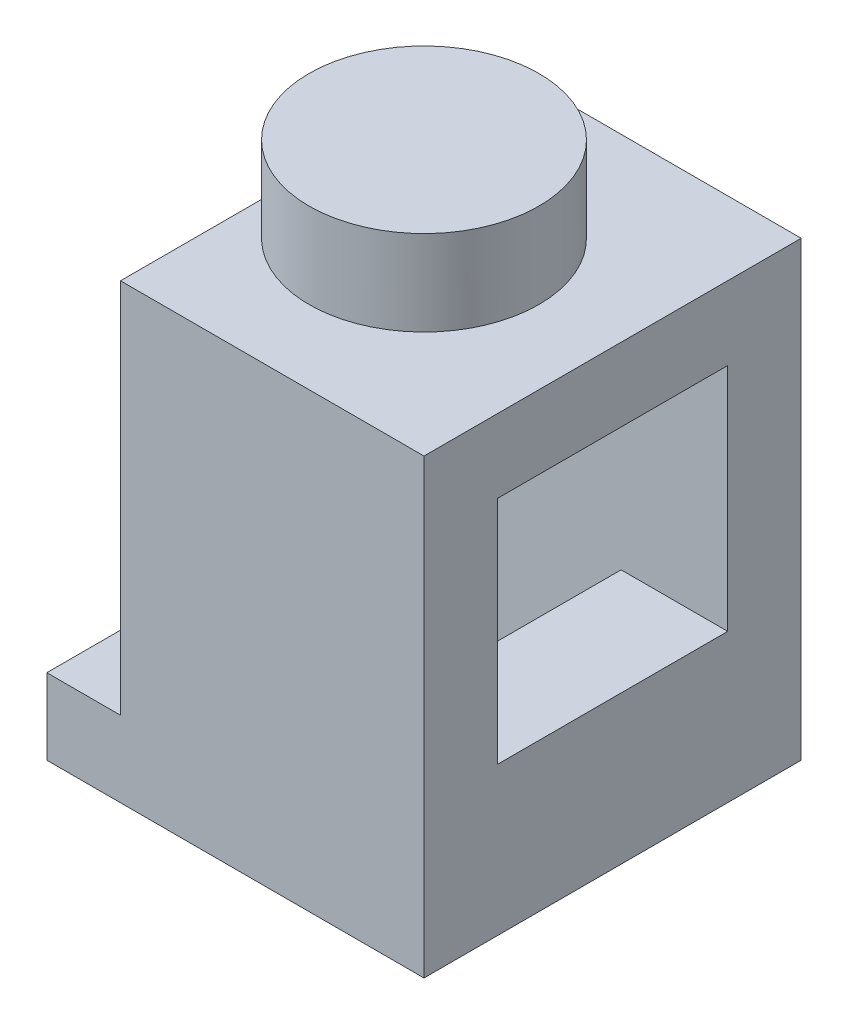
ISO-10303-21;
HEADER;
FILE_DESCRIPTION(('STEP AP214'),'2;1');
FILE_NAME('part.step','',(''),(''),'','','');
FILE_SCHEMA(('AUTOMOTIVE_DESIGN { 1 0 10303 214 1 1 1 1 }'));
ENDSEC;
DATA;
#1=APPLICATION_CONTEXT('core data for automotive mechanical design processes');
#2=APPLICATION_PROTOCOL_DEFINITION('international standard','automotive_design',2000,#1);
#3=PRODUCT_CONTEXT('',#1,'mechanical');
#4=PRODUCT('Part','Part','',(#3));
#5=PRODUCT_RELATED_PRODUCT_CATEGORY('part','',(#4));
#6=PRODUCT_DEFINITION_FORMATION('','',#4);
#7=PRODUCT_DEFINITION_CONTEXT('part definition',#1,'design');
#8=PRODUCT_DEFINITION('design','',#6,#7);
#9=PRODUCT_DEFINITION_SHAPE('','',#8);
#10=(LENGTH_UNIT() NAMED_UNIT(*) SI_UNIT(.MILLI.,.METRE.));
#11=(NAMED_UNIT(*) PLANE_ANGLE_UNIT() SI_UNIT($,.RADIAN.));
#12=(NAMED_UNIT(*) SI_UNIT($,.STERADIAN.) SOLID_ANGLE_UNIT());
#13=UNCERTAINTY_MEASURE_WITH_UNIT(LENGTH_MEASURE(1.E-05),#10,'distance_accuracy_value','');
#14=(GEOMETRIC_REPRESENTATION_CONTEXT(3) GLOBAL_UNCERTAINTY_ASSIGNED_CONTEXT((#13)) GLOBAL_UNIT_ASSIGNED_CONTEXT((#10,
#11,#12)) REPRESENTATION_CONTEXT('',''));
#15=CARTESIAN_POINT('',(0.,0.,0.));
#16=DIRECTION('',(0.,0.,1.));
#17=DIRECTION('',(1.,0.,0.));
#18=AXIS2_PLACEMENT_3D('',#15,#16,#17);
#19=CARTESIAN_POINT('',(-2.425,1.6,-3.98));
#20=DIRECTION('',(1.,0.,0.));
#21=DIRECTION('',(0.,0.,-1.));
#22=AXIS2_PLACEMENT_3D('',#19,#20,#21);
#23=PLANE('',#22);
#24=DIRECTION('',(0.,0.,1.));
#25=VECTOR('',#24,1.);
#26=CARTESIAN_POINT('',(-2.425,1.6,2.43));
#27=LINE('',#26,#25);
#28=CARTESIAN_POINT('',(-2.425,1.6,-2.43));
#29=VERTEX_POINT('',#28);
#30=CARTESIAN_POINT('',(-2.425,1.6,2.43));
#31=VERTEX_POINT('',#30);
#32=EDGE_CURVE('E205',#29,#31,#27,.T.);
#33=ORIENTED_EDGE('',*,*,#32,.T.);
#34=DIRECTION('',(0.,0.,-1.));
#35=VECTOR('',#34,1.);
#36=CARTESIAN_POINT('',(-2.425,1.6,-3.98));
#37=LINE('',#36,#35);
#38=CARTESIAN_POINT('',(-2.425,1.6,3.98));
#39=VERTEX_POINT('',#38);
#40=EDGE_CURVE('E226',#39,#31,#37,.T.);
#41=ORIENTED_EDGE('',*,*,#40,.F.);
#42=DIRECTION('',(0.,1.,0.));
#43=VECTOR('',#42,1.);
#44=CARTESIAN_POINT('',(-2.425,1.6,3.98));
#45=LINE('',#44,#43);
#46=CARTESIAN_POINT('',(-2.425,9.54,3.98));
#47=VERTEX_POINT('',#46);
#48=EDGE_CURVE('E231',#39,#47,#45,.T.);
#49=ORIENTED_EDGE('',*,*,#48,.T.);
#50=DIRECTION('',(0.,0.,-1.));
#51=VECTOR('',#50,1.);
#52=CARTESIAN_POINT('',(-2.425,9.54,-3.98));
#53=LINE('',#52,#51);
#54=CARTESIAN_POINT('',(-2.425,9.54,0.));
#55=VERTEX_POINT('',#54);
#56=EDGE_CURVE('E222',#47,#55,#53,.T.);
#57=ORIENTED_EDGE('',*,*,#56,.T.);
#58=CARTESIAN_POINT('',(-2.425,9.54,-3.98));
#59=VERTEX_POINT('',#58);
#60=EDGE_CURVE('E208',#55,#59,#53,.T.);
#61=ORIENTED_EDGE('',*,*,#60,.T.);
#62=DIRECTION('',(0.,1.,0.));
#63=VECTOR('',#62,1.);
#64=CARTESIAN_POINT('',(-2.425,1.6,-3.98));
#65=LINE('',#64,#63);
#66=CARTESIAN_POINT('',(-2.425,1.6,-3.98));
#67=VERTEX_POINT('',#66);
#68=EDGE_CURVE('E233',#67,#59,#65,.T.);
#69=ORIENTED_EDGE('',*,*,#68,.F.);
#70=EDGE_CURVE('E225',#29,#67,#37,.T.);
#71=ORIENTED_EDGE('',*,*,#70,.F.);
#72=EDGE_LOOP('',(#33,#41,#49,#57,#61,#69,#71));
#73=FACE_BOUND('',#72,.T.);
#74=CARTESIAN_POINT('',(-2.425,5.56,0.));
#75=DIRECTION('',(1.,0.,0.));
#76=DIRECTION('',(0.,0.,-1.));
#77=AXIS2_PLACEMENT_3D('',#74,#75,#76);
#78=CIRCLE('',#77,2.425);
#79=CARTESIAN_POINT('',(-2.425,5.56,-2.425));
#80=VERTEX_POINT('',#79);
#81=EDGE_CURVE('E11',#80,#80,#78,.F.);
#82=ORIENTED_EDGE('',*,*,#81,.F.);
#83=EDGE_LOOP('',(#82));
#84=FACE_BOUND('',#83,.T.);
#85=ADVANCED_FACE('F30',(#73,#84),#23,.F.);
#86=CARTESIAN_POINT('',(1.73,-3.3101527471149,2.43));
#87=DIRECTION('',(1.,0.,0.));
#88=DIRECTION('',(0.,0.,-1.));
#89=AXIS2_PLACEMENT_3D('',#86,#87,#88);
#90=PLANE('',#89);
#91=DIRECTION('',(0.,1.,0.));
#92=VECTOR('',#91,1.);
#93=CARTESIAN_POINT('',(1.73,-3.3101527471149,2.43));
#94=LINE('',#93,#92);
#95=CARTESIAN_POINT('',(1.73,1.6,2.43));
#96=VERTEX_POINT('',#95);
#97=CARTESIAN_POINT('',(1.73,3.13,2.43));
#98=VERTEX_POINT('',#97);
#99=EDGE_CURVE('E186',#96,#98,#94,.T.);
#100=ORIENTED_EDGE('',*,*,#99,.T.);
#101=DIRECTION('',(0.,0.,1.));
#102=VECTOR('',#101,1.);
#103=CARTESIAN_POINT('',(1.73,3.13,2.43));
#104=LINE('',#103,#102);
#105=CARTESIAN_POINT('',(1.73,3.13,-2.43));
#106=VERTEX_POINT('',#105);
#107=EDGE_CURVE('E53',#106,#98,#104,.T.);
#108=ORIENTED_EDGE('',*,*,#107,.F.);
#109=DIRECTION('',(0.,1.,0.));
#110=VECTOR('',#109,1.);
#111=CARTESIAN_POINT('',(1.73,-3.3101527471149,-2.43));
#112=LINE('',#111,#110);
#113=CARTESIAN_POINT('',(1.73,1.6,-2.43));
#114=VERTEX_POINT('',#113);
#115=EDGE_CURVE('E187',#114,#106,#112,.T.);
#116=ORIENTED_EDGE('',*,*,#115,.F.);
#117=DIRECTION('',(0.,0.,1.));
#118=VECTOR('',#117,1.);
#119=CARTESIAN_POINT('',(1.73,1.6,2.43));
#120=LINE('',#119,#118);
#121=EDGE_CURVE('E197',#114,#96,#120,.T.);
#122=ORIENTED_EDGE('',*,*,#121,.T.);
#123=EDGE_LOOP('',(#100,#108,#116,#122));
#124=FACE_BOUND('',#123,.T.);
#125=ADVANCED_FACE('F366',(#124),#90,.F.);
#126=CARTESIAN_POINT('',(-3.98,9.54,-2.43));
#127=DIRECTION('',(0.,0.,1.));
#128=DIRECTION('',(1.,0.,0.));
#129=AXIS2_PLACEMENT_3D('',#126,#127,#128);
#130=PLANE('',#129);
#131=DIRECTION('',(-1.,0.,0.));
#132=VECTOR('',#131,1.);
#133=CARTESIAN_POINT('',(2.43,1.6,-2.43));
#134=LINE('',#133,#132);
#135=CARTESIAN_POINT('',(2.43,1.6,-2.43));
#136=VERTEX_POINT('',#135);
#137=EDGE_CURVE('E190',#136,#114,#134,.T.);
#138=ORIENTED_EDGE('',*,*,#137,.T.);
#139=ORIENTED_EDGE('',*,*,#115,.T.);
#140=DIRECTION('',(1.,0.,0.));
#141=VECTOR('',#140,1.);
#142=CARTESIAN_POINT('',(-3.981,3.13,-2.43));
#143=LINE('',#142,#141);
#144=CARTESIAN_POINT('',(3.98,3.13,-2.43));
#145=VERTEX_POINT('',#144);
#146=EDGE_CURVE('E625',#106,#145,#143,.T.);
#147=ORIENTED_EDGE('',*,*,#146,.T.);
#148=DIRECTION('',(0.,1.,0.));
#149=VECTOR('',#148,1.);
#150=CARTESIAN_POINT('',(3.98,7.99,-2.43));
#151=LINE('',#150,#149);
#152=CARTESIAN_POINT('',(3.98,7.99,-2.43));
#153=VERTEX_POINT('',#152);
#154=EDGE_CURVE('E617',#145,#153,#151,.T.);
#155=ORIENTED_EDGE('',*,*,#154,.T.);
#156=DIRECTION('',(1.,0.,0.));
#157=VECTOR('',#156,1.);
#158=CARTESIAN_POINT('',(-3.981,7.99,-2.43));
#159=LINE('',#158,#157);
#160=CARTESIAN_POINT('',(1.73,7.99,-2.43));
#161=VERTEX_POINT('',#160);
#162=EDGE_CURVE('E172',#161,#153,#159,.T.);
#163=ORIENTED_EDGE('',*,*,#162,.F.);
#164=CARTESIAN_POINT('',(1.73,8.13,-2.43));
#165=VERTEX_POINT('',#164);
#166=EDGE_CURVE('E179',#161,#165,#112,.T.);
#167=ORIENTED_EDGE('',*,*,#166,.T.);
#168=DIRECTION('',(1.,0.,0.));
#169=VECTOR('',#168,1.);
#170=CARTESIAN_POINT('',(2.43,8.13,-2.43));
#171=LINE('',#170,#169);
#172=CARTESIAN_POINT('',(-1.725,8.13,-2.43));
#173=VERTEX_POINT('',#172);
#174=EDGE_CURVE('E244',#173,#165,#171,.T.);
#175=ORIENTED_EDGE('',*,*,#174,.F.);
#176=DIRECTION('',(0.,1.,0.));
#177=VECTOR('',#176,1.);
#178=CARTESIAN_POINT('',(-1.725,-3.3101527471149,-2.43));
#179=LINE('',#178,#177);
#180=CARTESIAN_POINT('',(-1.725,1.6,-2.43));
#181=VERTEX_POINT('',#180);
#182=EDGE_CURVE('E215',#181,#173,#179,.T.);
#183=ORIENTED_EDGE('',*,*,#182,.F.);
#184=DIRECTION('',(-1.,0.,0.));
#185=VECTOR('',#184,1.);
#186=CARTESIAN_POINT('',(-2.425,1.6,-2.43));
#187=LINE('',#186,#185);
#188=EDGE_CURVE('E201',#181,#29,#187,.T.);
#189=ORIENTED_EDGE('',*,*,#188,.T.);
#190=DIRECTION('',(-1.,0.,0.));
#191=VECTOR('',#190,1.);
#192=CARTESIAN_POINT('',(-3.98,1.6,-2.43));
#193=LINE('',#192,#191);
#194=CARTESIAN_POINT('',(-2.43,1.6,-2.43));
#195=VERTEX_POINT('',#194);
#196=EDGE_CURVE('E240',#29,#195,#193,.T.);
#197=ORIENTED_EDGE('',*,*,#196,.T.);
#198=DIRECTION('',(0.,-1.,0.));
#199=VECTOR('',#198,1.);
#200=CARTESIAN_POINT('',(-2.43,9.54,-2.43));
#201=LINE('',#200,#199);
#202=CARTESIAN_POINT('',(-2.43,0.,-2.43));
#203=VERTEX_POINT('',#202);
#204=EDGE_CURVE('E251',#195,#203,#201,.T.);
#205=ORIENTED_EDGE('',*,*,#204,.T.);
#206=DIRECTION('',(-1.,0.,0.));
#207=VECTOR('',#206,1.);
#208=CARTESIAN_POINT('',(-3.98,0.,-2.43));
#209=LINE('',#208,#207);
#210=CARTESIAN_POINT('',(2.43,0.,-2.43));
#211=VERTEX_POINT('',#210);
#212=EDGE_CURVE('E264',#211,#203,#209,.T.);
#213=ORIENTED_EDGE('',*,*,#212,.F.);
#214=DIRECTION('',(0.,-1.,0.));
#215=VECTOR('',#214,1.);
#216=CARTESIAN_POINT('',(2.43,9.54,-2.43));
#217=LINE('',#216,#215);
#218=EDGE_CURVE('E248',#136,#211,#217,.T.);
#219=ORIENTED_EDGE('',*,*,#218,.F.);
#220=EDGE_LOOP('',(#138,#139,#147,#155,#163,#167,#175,#183,#189,#197,#205,#213,#219));
#221=FACE_BOUND('',#220,.T.);
#222=ADVANCED_FACE('F319',(#221),#130,.T.);
#223=CARTESIAN_POINT('',(-3.98,9.54,2.43));
#224=DIRECTION('',(0.,0.,-1.));
#225=DIRECTION('',(-1.,0.,0.));
#226=AXIS2_PLACEMENT_3D('',#223,#224,#225);
#227=PLANE('',#226);
#228=DIRECTION('',(-1.,0.,0.));
#229=VECTOR('',#228,1.);
#230=CARTESIAN_POINT('',(-2.43,8.13,2.43));
#231=LINE('',#230,#229);
#232=CARTESIAN_POINT('',(1.73,8.13,2.43));
#233=VERTEX_POINT('',#232);
#234=CARTESIAN_POINT('',(-1.725,8.13,2.43));
#235=VERTEX_POINT('',#234);
#236=EDGE_CURVE('E185',#233,#235,#231,.T.);
#237=ORIENTED_EDGE('',*,*,#236,.F.);
#238=CARTESIAN_POINT('',(1.73,7.99,2.43));
#239=VERTEX_POINT('',#238);
#240=EDGE_CURVE('E177',#239,#233,#94,.T.);
#241=ORIENTED_EDGE('',*,*,#240,.F.);
#242=DIRECTION('',(1.,0.,0.));
#243=VECTOR('',#242,1.);
#244=CARTESIAN_POINT('',(-3.981,7.99,2.43));
#245=LINE('',#244,#243);
#246=CARTESIAN_POINT('',(3.98,7.99,2.43));
#247=VERTEX_POINT('',#246);
#248=EDGE_CURVE('E162',#239,#247,#245,.T.);
#249=ORIENTED_EDGE('',*,*,#248,.T.);
#250=DIRECTION('',(0.,-1.,0.));
#251=VECTOR('',#250,1.);
#252=CARTESIAN_POINT('',(3.98,7.99,2.43));
#253=LINE('',#252,#251);
#254=CARTESIAN_POINT('',(3.98,3.13,2.43));
#255=VERTEX_POINT('',#254);
#256=EDGE_CURVE('E627',#247,#255,#253,.T.);
#257=ORIENTED_EDGE('',*,*,#256,.T.);
#258=DIRECTION('',(1.,0.,0.));
#259=VECTOR('',#258,1.);
#260=CARTESIAN_POINT('',(-3.981,3.13,2.43));
#261=LINE('',#260,#259);
#262=EDGE_CURVE('E171',#98,#255,#261,.T.);
#263=ORIENTED_EDGE('',*,*,#262,.F.);
#264=ORIENTED_EDGE('',*,*,#99,.F.);
#265=DIRECTION('',(1.,0.,0.));
#266=VECTOR('',#265,1.);
#267=CARTESIAN_POINT('',(2.43,1.6,2.43));
#268=LINE('',#267,#266);
#269=CARTESIAN_POINT('',(2.43,1.6,2.43));
#270=VERTEX_POINT('',#269);
#271=EDGE_CURVE('E638',#96,#270,#268,.T.);
#272=ORIENTED_EDGE('',*,*,#271,.T.);
#273=DIRECTION('',(0.,-1.,0.));
#274=VECTOR('',#273,1.);
#275=CARTESIAN_POINT('',(2.43,9.54,2.43));
#276=LINE('',#275,#274);
#277=CARTESIAN_POINT('',(2.43,0.,2.43));
#278=VERTEX_POINT('',#277);
#279=EDGE_CURVE('E252',#270,#278,#276,.T.);
#280=ORIENTED_EDGE('',*,*,#279,.T.);
#281=DIRECTION('',(1.,0.,0.));
#282=VECTOR('',#281,1.);
#283=CARTESIAN_POINT('',(-3.98,0.,2.43));
#284=LINE('',#283,#282);
#285=CARTESIAN_POINT('',(-2.43,0.,2.43));
#286=VERTEX_POINT('',#285);
#287=EDGE_CURVE('E255',#286,#278,#284,.T.);
#288=ORIENTED_EDGE('',*,*,#287,.F.);
#289=DIRECTION('',(0.,-1.,0.));
#290=VECTOR('',#289,1.);
#291=CARTESIAN_POINT('',(-2.43,9.54,2.43));
#292=LINE('',#291,#290);
#293=CARTESIAN_POINT('',(-2.43,1.6,2.43));
#294=VERTEX_POINT('',#293);
#295=EDGE_CURVE('E254',#294,#286,#292,.T.);
#296=ORIENTED_EDGE('',*,*,#295,.F.);
#297=DIRECTION('',(1.,0.,0.));
#298=VECTOR('',#297,1.);
#299=CARTESIAN_POINT('',(-3.98,1.6,2.43));
#300=LINE('',#299,#298);
#301=EDGE_CURVE('E38',#294,#31,#300,.T.);
#302=ORIENTED_EDGE('',*,*,#301,.T.);
#303=DIRECTION('',(1.,0.,0.));
#304=VECTOR('',#303,1.);
#305=CARTESIAN_POINT('',(-2.425,1.6,2.43));
#306=LINE('',#305,#304);
#307=CARTESIAN_POINT('',(-1.725,1.6,2.43));
#308=VERTEX_POINT('',#307);
#309=EDGE_CURVE('E202',#31,#308,#306,.T.);
#310=ORIENTED_EDGE('',*,*,#309,.T.);
#311=DIRECTION('',(0.,1.,0.));
#312=VECTOR('',#311,1.);
#313=CARTESIAN_POINT('',(-1.725,-3.3101527471149,2.43));
#314=LINE('',#313,#312);
#315=EDGE_CURVE('E212',#308,#235,#314,.T.);
#316=ORIENTED_EDGE('',*,*,#315,.T.);
#317=EDGE_LOOP('',(#237,#241,#249,#257,#263,#264,#272,#280,#288,#296,#302,#310,#316));
#318=FACE_BOUND('',#317,.T.);
#319=ADVANCED_FACE('F183',(#318),#227,.T.);
#320=CARTESIAN_POINT('',(2.43,8.13,-2.43));
#321=DIRECTION('',(0.,1.,0.));
#322=DIRECTION('',(0.,0.,1.));
#323=AXIS2_PLACEMENT_3D('',#320,#321,#322);
#324=PLANE('',#323);
#325=CARTESIAN_POINT('',(0.,8.13,0.));
#326=DIRECTION('',(0.,1.,0.));
#327=DIRECTION('',(0.,0.,1.));
#328=AXIS2_PLACEMENT_3D('',#325,#326,#327);
#329=CIRCLE('',#328,0.875);
#330=CARTESIAN_POINT('',(0.,8.13,0.875));
#331=VERTEX_POINT('',#330);
#332=EDGE_CURVE('E247',#331,#331,#329,.T.);
#333=ORIENTED_EDGE('',*,*,#332,.T.);
#334=EDGE_LOOP('',(#333));
#335=FACE_BOUND('',#334,.T.);
#336=DIRECTION('',(0.,0.,-1.));
#337=VECTOR('',#336,1.);
#338=CARTESIAN_POINT('',(1.73,8.13,2.43));
#339=LINE('',#338,#337);
#340=EDGE_CURVE('E635',#233,#165,#339,.T.);
#341=ORIENTED_EDGE('',*,*,#340,.F.);
#342=ORIENTED_EDGE('',*,*,#236,.T.);
#343=DIRECTION('',(0.,0.,1.));
#344=VECTOR('',#343,1.);
#345=CARTESIAN_POINT('',(-1.725,8.13,2.43));
#346=LINE('',#345,#344);
#347=EDGE_CURVE('E209',#173,#235,#346,.T.);
#348=ORIENTED_EDGE('',*,*,#347,.F.);
#349=ORIENTED_EDGE('',*,*,#174,.T.);
#350=EDGE_LOOP('',(#341,#342,#348,#349));
#351=FACE_BOUND('',#350,.T.);
#352=ADVANCED_FACE('F376',(#335,#351),#324,.F.);
#353=CARTESIAN_POINT('',(2.43,9.54,-3.98));
#354=DIRECTION('',(-1.,0.,0.));
#355=DIRECTION('',(0.,0.,1.));
#356=AXIS2_PLACEMENT_3D('',#353,#354,#355);
#357=PLANE('',#356);
#358=ORIENTED_EDGE('',*,*,#279,.F.);
#359=DIRECTION('',(0.,0.,-1.));
#360=VECTOR('',#359,1.);
#361=CARTESIAN_POINT('',(2.43,1.6,2.43));
#362=LINE('',#361,#360);
#363=EDGE_CURVE('E213',#270,#136,#362,.T.);
#364=ORIENTED_EDGE('',*,*,#363,.T.);
#365=ORIENTED_EDGE('',*,*,#218,.T.);
#366=DIRECTION('',(0.,0.,-1.));
#367=VECTOR('',#366,1.);
#368=CARTESIAN_POINT('',(2.43,0.,-3.98));
#369=LINE('',#368,#367);
#370=EDGE_CURVE('E261',#278,#211,#369,.T.);
#371=ORIENTED_EDGE('',*,*,#370,.F.);
#372=EDGE_LOOP('',(#358,#364,#365,#371));
#373=FACE_BOUND('',#372,.T.);
#374=ADVANCED_FACE('F379',(#373),#357,.T.);
#375=CARTESIAN_POINT('',(-3.98,9.54,-3.98));
#376=DIRECTION('',(1.,0.,0.));
#377=DIRECTION('',(0.,0.,-1.));
#378=AXIS2_PLACEMENT_3D('',#375,#376,#377);
#379=PLANE('',#378);
#380=DIRECTION('',(0.,0.,1.));
#381=VECTOR('',#380,1.);
#382=CARTESIAN_POINT('',(-3.98,1.6,-3.98));
#383=LINE('',#382,#381);
#384=CARTESIAN_POINT('',(-3.98,1.6,-3.98));
#385=VERTEX_POINT('',#384);
#386=CARTESIAN_POINT('',(-3.98,1.6,3.98));
#387=VERTEX_POINT('',#386);
#388=EDGE_CURVE('E219',#385,#387,#383,.T.);
#389=ORIENTED_EDGE('',*,*,#388,.F.);
#390=DIRECTION('',(0.,-1.,0.));
#391=VECTOR('',#390,1.);
#392=CARTESIAN_POINT('',(-3.98,9.54,-3.98));
#393=LINE('',#392,#391);
#394=CARTESIAN_POINT('',(-3.98,0.,-3.98));
#395=VERTEX_POINT('',#394);
#396=EDGE_CURVE('E301',#385,#395,#393,.T.);
#397=ORIENTED_EDGE('',*,*,#396,.T.);
#398=DIRECTION('',(0.,0.,1.));
#399=VECTOR('',#398,1.);
#400=CARTESIAN_POINT('',(-3.98,0.,-3.98));
#401=LINE('',#400,#399);
#402=CARTESIAN_POINT('',(-3.98,0.,3.98));
#403=VERTEX_POINT('',#402);
#404=EDGE_CURVE('E293',#395,#403,#401,.T.);
#405=ORIENTED_EDGE('',*,*,#404,.T.);
#406=DIRECTION('',(0.,-1.,0.));
#407=VECTOR('',#406,1.);
#408=CARTESIAN_POINT('',(-3.98,9.54,3.98));
#409=LINE('',#408,#407);
#410=EDGE_CURVE('E299',#387,#403,#409,.T.);
#411=ORIENTED_EDGE('',*,*,#410,.F.);
#412=EDGE_LOOP('',(#389,#397,#405,#411));
#413=FACE_BOUND('',#412,.T.);
#414=ADVANCED_FACE('F335',(#413),#379,.F.);
#415=CARTESIAN_POINT('',(-2.43,9.54,-3.98));
#416=DIRECTION('',(1.,0.,0.));
#417=DIRECTION('',(0.,0.,-1.));
#418=AXIS2_PLACEMENT_3D('',#415,#416,#417);
#419=PLANE('',#418);
#420=ORIENTED_EDGE('',*,*,#204,.F.);
#421=DIRECTION('',(0.,0.,1.));
#422=VECTOR('',#421,1.);
#423=CARTESIAN_POINT('',(-2.43,1.6,-3.98));
#424=LINE('',#423,#422);
#425=EDGE_CURVE('E236',#195,#294,#424,.T.);
#426=ORIENTED_EDGE('',*,*,#425,.T.);
#427=ORIENTED_EDGE('',*,*,#295,.T.);
#428=DIRECTION('',(0.,0.,1.));
#429=VECTOR('',#428,1.);
#430=CARTESIAN_POINT('',(-2.43,0.,-3.98));
#431=LINE('',#430,#429);
#432=EDGE_CURVE('E267',#203,#286,#431,.T.);
#433=ORIENTED_EDGE('',*,*,#432,.F.);
#434=EDGE_LOOP('',(#420,#426,#427,#433));
#435=FACE_BOUND('',#434,.T.);
#436=ADVANCED_FACE('F315',(#435),#419,.T.);
#437=CARTESIAN_POINT('',(3.98,9.54,3.98));
#438=DIRECTION('',(0.,1.,0.));
#439=DIRECTION('',(0.,0.,1.));
#440=AXIS2_PLACEMENT_3D('',#437,#438,#439);
#441=PLANE('',#440);
#442=ORIENTED_EDGE('',*,*,#56,.F.);
#443=DIRECTION('',(1.,0.,0.));
#444=VECTOR('',#443,1.);
#445=CARTESIAN_POINT('',(-3.98,9.54,3.98));
#446=LINE('',#445,#444);
#447=CARTESIAN_POINT('',(3.98,9.54,3.98));
#448=VERTEX_POINT('',#447);
#449=EDGE_CURVE('E285',#47,#448,#446,.T.);
#450=ORIENTED_EDGE('',*,*,#449,.T.);
#451=DIRECTION('',(0.,0.,-1.));
#452=VECTOR('',#451,1.);
#453=CARTESIAN_POINT('',(3.98,9.54,-3.98));
#454=LINE('',#453,#452);
#455=CARTESIAN_POINT('',(3.98,9.54,-3.98));
#456=VERTEX_POINT('',#455);
#457=EDGE_CURVE('E278',#448,#456,#454,.T.);
#458=ORIENTED_EDGE('',*,*,#457,.T.);
#459=DIRECTION('',(-1.,0.,0.));
#460=VECTOR('',#459,1.);
#461=CARTESIAN_POINT('',(-3.98,9.54,-3.98));
#462=LINE('',#461,#460);
#463=EDGE_CURVE('E281',#456,#59,#462,.T.);
#464=ORIENTED_EDGE('',*,*,#463,.T.);
#465=ORIENTED_EDGE('',*,*,#60,.F.);
#466=CARTESIAN_POINT('',(0.,9.54,0.));
#467=DIRECTION('',(0.,1.,0.));
#468=DIRECTION('',(0.,0.,1.));
#469=AXIS2_PLACEMENT_3D('',#466,#467,#468);
#470=CIRCLE('',#469,2.425);
#471=EDGE_CURVE('E250',#55,#55,#470,.T.);
#472=ORIENTED_EDGE('',*,*,#471,.F.);
#473=EDGE_LOOP('',(#442,#450,#458,#464,#465,#472));
#474=FACE_BOUND('',#473,.T.);
#475=ADVANCED_FACE('F346',(#474),#441,.T.);
#476=CARTESIAN_POINT('',(3.98,9.54,-3.98));
#477=DIRECTION('',(-1.,0.,0.));
#478=DIRECTION('',(0.,0.,1.));
#479=AXIS2_PLACEMENT_3D('',#476,#477,#478);
#480=PLANE('',#479);
#481=ORIENTED_EDGE('',*,*,#154,.F.);
#482=DIRECTION('',(0.,0.,-1.));
#483=VECTOR('',#482,1.);
#484=CARTESIAN_POINT('',(3.98,3.13,2.43));
#485=LINE('',#484,#483);
#486=EDGE_CURVE('E623',#255,#145,#485,.T.);
#487=ORIENTED_EDGE('',*,*,#486,.F.);
#488=ORIENTED_EDGE('',*,*,#256,.F.);
#489=DIRECTION('',(0.,0.,1.));
#490=VECTOR('',#489,1.);
#491=CARTESIAN_POINT('',(3.98,7.99,2.43));
#492=LINE('',#491,#490);
#493=EDGE_CURVE('E45',#153,#247,#492,.T.);
#494=ORIENTED_EDGE('',*,*,#493,.F.);
#495=EDGE_LOOP('',(#481,#487,#488,#494));
#496=FACE_BOUND('',#495,.T.);
#497=DIRECTION('',(0.,0.,-1.));
#498=VECTOR('',#497,1.);
#499=CARTESIAN_POINT('',(3.98,0.,-3.98));
#500=LINE('',#499,#498);
#501=CARTESIAN_POINT('',(3.98,0.,3.98));
#502=VERTEX_POINT('',#501);
#503=CARTESIAN_POINT('',(3.98,0.,-3.98));
#504=VERTEX_POINT('',#503);
#505=EDGE_CURVE('E275',#502,#504,#500,.T.);
#506=ORIENTED_EDGE('',*,*,#505,.T.);
#507=DIRECTION('',(0.,-1.,0.));
#508=VECTOR('',#507,1.);
#509=CARTESIAN_POINT('',(3.98,9.54,-3.98));
#510=LINE('',#509,#508);
#511=EDGE_CURVE('E303',#456,#504,#510,.T.);
#512=ORIENTED_EDGE('',*,*,#511,.F.);
#513=ORIENTED_EDGE('',*,*,#457,.F.);
#514=DIRECTION('',(0.,-1.,0.));
#515=VECTOR('',#514,1.);
#516=CARTESIAN_POINT('',(3.98,9.54,3.98));
#517=LINE('',#516,#515);
#518=EDGE_CURVE('E287',#448,#502,#517,.T.);
#519=ORIENTED_EDGE('',*,*,#518,.T.);
#520=EDGE_LOOP('',(#506,#512,#513,#519));
#521=FACE_BOUND('',#520,.T.);
#522=ADVANCED_FACE('F32',(#496,#521),#480,.F.);
#523=CARTESIAN_POINT('',(-3.98,9.54,-3.98));
#524=DIRECTION('',(0.,0.,1.));
#525=DIRECTION('',(1.,0.,0.));
#526=AXIS2_PLACEMENT_3D('',#523,#524,#525);
#527=PLANE('',#526);
#528=DIRECTION('',(-1.,0.,0.));
#529=VECTOR('',#528,1.);
#530=CARTESIAN_POINT('',(-3.98,1.6,-3.98));
#531=LINE('',#530,#529);
#532=EDGE_CURVE('E229',#67,#385,#531,.T.);
#533=ORIENTED_EDGE('',*,*,#532,.F.);
#534=ORIENTED_EDGE('',*,*,#68,.T.);
#535=ORIENTED_EDGE('',*,*,#463,.F.);
#536=ORIENTED_EDGE('',*,*,#511,.T.);
#537=DIRECTION('',(-1.,0.,0.));
#538=VECTOR('',#537,1.);
#539=CARTESIAN_POINT('',(-3.98,0.,-3.98));
#540=LINE('',#539,#538);
#541=EDGE_CURVE('E290',#504,#395,#540,.T.);
#542=ORIENTED_EDGE('',*,*,#541,.T.);
#543=ORIENTED_EDGE('',*,*,#396,.F.);
#544=EDGE_LOOP('',(#533,#534,#535,#536,#542,#543));
#545=FACE_BOUND('',#544,.T.);
#546=ADVANCED_FACE('F330',(#545),#527,.F.);
#547=CARTESIAN_POINT('',(-3.98,9.54,3.98));
#548=DIRECTION('',(0.,0.,-1.));
#549=DIRECTION('',(-1.,0.,0.));
#550=AXIS2_PLACEMENT_3D('',#547,#548,#549);
#551=PLANE('',#550);
#552=ORIENTED_EDGE('',*,*,#449,.F.);
#553=ORIENTED_EDGE('',*,*,#48,.F.);
#554=DIRECTION('',(1.,0.,0.));
#555=VECTOR('',#554,1.);
#556=CARTESIAN_POINT('',(-3.98,1.6,3.98));
#557=LINE('',#556,#555);
#558=EDGE_CURVE('E221',#387,#39,#557,.T.);
#559=ORIENTED_EDGE('',*,*,#558,.F.);
#560=ORIENTED_EDGE('',*,*,#410,.T.);
#561=DIRECTION('',(1.,0.,0.));
#562=VECTOR('',#561,1.);
#563=CARTESIAN_POINT('',(-3.98,0.,3.98));
#564=LINE('',#563,#562);
#565=EDGE_CURVE('E282',#403,#502,#564,.T.);
#566=ORIENTED_EDGE('',*,*,#565,.T.);
#567=ORIENTED_EDGE('',*,*,#518,.F.);
#568=EDGE_LOOP('',(#552,#553,#559,#560,#566,#567));
#569=FACE_BOUND('',#568,.T.);
#570=ADVANCED_FACE('F340',(#569),#551,.F.);
#571=CARTESIAN_POINT('',(3.98,0.,3.98));
#572=DIRECTION('',(0.,1.,0.));
#573=DIRECTION('',(0.,0.,1.));
#574=AXIS2_PLACEMENT_3D('',#571,#572,#573);
#575=PLANE('',#574);
#576=ORIENTED_EDGE('',*,*,#287,.T.);
#577=ORIENTED_EDGE('',*,*,#370,.T.);
#578=ORIENTED_EDGE('',*,*,#212,.T.);
#579=ORIENTED_EDGE('',*,*,#432,.T.);
#580=EDGE_LOOP('',(#576,#577,#578,#579));
#581=FACE_BOUND('',#580,.T.);
#582=ORIENTED_EDGE('',*,*,#505,.F.);
#583=ORIENTED_EDGE('',*,*,#565,.F.);
#584=ORIENTED_EDGE('',*,*,#404,.F.);
#585=ORIENTED_EDGE('',*,*,#541,.F.);
#586=EDGE_LOOP('',(#582,#583,#584,#585));
#587=FACE_BOUND('',#586,.T.);
#588=ADVANCED_FACE('F351',(#581,#587),#575,.F.);
#589=CARTESIAN_POINT('',(0.,11.34,0.));
#590=DIRECTION('',(0.,-1.,0.));
#591=DIRECTION('',(0.,0.,-1.));
#592=AXIS2_PLACEMENT_3D('',#589,#590,#591);
#593=CYLINDRICAL_SURFACE('',#592,2.425);
#594=CARTESIAN_POINT('',(0.,11.34,0.));
#595=DIRECTION('',(0.,1.,0.));
#596=DIRECTION('',(0.,0.,1.));
#597=AXIS2_PLACEMENT_3D('',#594,#595,#596);
#598=CIRCLE('',#597,2.425);
#599=CARTESIAN_POINT('',(0.,11.34,2.425));
#600=VERTEX_POINT('',#599);
#601=EDGE_CURVE('E272',#600,#600,#598,.T.);
#602=ORIENTED_EDGE('',*,*,#601,.F.);
#603=EDGE_LOOP('',(#602));
#604=FACE_BOUND('',#603,.T.);
#605=ORIENTED_EDGE('',*,*,#471,.T.);
#606=EDGE_LOOP('',(#605));
#607=FACE_BOUND('',#606,.T.);
#608=ADVANCED_FACE('F348',(#604,#607),#593,.T.);
#609=CARTESIAN_POINT('',(0.,11.34,0.));
#610=DIRECTION('',(0.,1.,0.));
#611=DIRECTION('',(0.,0.,1.));
#612=AXIS2_PLACEMENT_3D('',#609,#610,#611);
#613=PLANE('',#612);
#614=ORIENTED_EDGE('',*,*,#601,.T.);
#615=EDGE_LOOP('',(#614));
#616=FACE_BOUND('',#615,.T.);
#617=ADVANCED_FACE('F350',(#616),#613,.T.);
#618=CARTESIAN_POINT('',(0.,9.79,0.));
#619=DIRECTION('',(0.,1.,0.));
#620=DIRECTION('',(0.,0.,1.));
#621=AXIS2_PLACEMENT_3D('',#618,#619,#620);
#622=PLANE('',#621);
#623=CARTESIAN_POINT('',(0.,9.79,0.));
#624=DIRECTION('',(0.,1.,0.));
#625=DIRECTION('',(0.,0.,1.));
#626=AXIS2_PLACEMENT_3D('',#623,#624,#625);
#627=CIRCLE('',#626,0.875);
#628=CARTESIAN_POINT('',(0.,9.79,0.875));
#629=VERTEX_POINT('',#628);
#630=EDGE_CURVE('E258',#629,#629,#627,.T.);
#631=ORIENTED_EDGE('',*,*,#630,.F.);
#632=EDGE_LOOP('',(#631));
#633=FACE_BOUND('',#632,.T.);
#634=ADVANCED_FACE('F358',(#633),#622,.F.);
#635=CARTESIAN_POINT('',(0.,11.34,0.));
#636=DIRECTION('',(0.,-1.,0.));
#637=DIRECTION('',(0.,0.,-1.));
#638=AXIS2_PLACEMENT_3D('',#635,#636,#637);
#639=CYLINDRICAL_SURFACE('',#638,0.875);
#640=ORIENTED_EDGE('',*,*,#332,.F.);
#641=EDGE_LOOP('',(#640));
#642=FACE_BOUND('',#641,.T.);
#643=ORIENTED_EDGE('',*,*,#630,.T.);
#644=EDGE_LOOP('',(#643));
#645=FACE_BOUND('',#644,.T.);
#646=ADVANCED_FACE('F390',(#642,#645),#639,.F.);
#647=CARTESIAN_POINT('',(-3.98,1.6,3.98));
#648=DIRECTION('',(0.,1.,0.));
#649=DIRECTION('',(0.,0.,1.));
#650=AXIS2_PLACEMENT_3D('',#647,#648,#649);
#651=PLANE('',#650);
#652=ORIENTED_EDGE('',*,*,#70,.T.);
#653=ORIENTED_EDGE('',*,*,#532,.T.);
#654=ORIENTED_EDGE('',*,*,#388,.T.);
#655=ORIENTED_EDGE('',*,*,#558,.T.);
#656=ORIENTED_EDGE('',*,*,#40,.T.);
#657=ORIENTED_EDGE('',*,*,#301,.F.);
#658=ORIENTED_EDGE('',*,*,#425,.F.);
#659=ORIENTED_EDGE('',*,*,#196,.F.);
#660=EDGE_LOOP('',(#652,#653,#654,#655,#656,#657,#658,#659));
#661=FACE_BOUND('',#660,.T.);
#662=ADVANCED_FACE('F311',(#661),#651,.T.);
#663=CARTESIAN_POINT('',(-1.725,-3.3101527471149,2.43));
#664=DIRECTION('',(-1.,0.,0.));
#665=DIRECTION('',(0.,0.,1.));
#666=AXIS2_PLACEMENT_3D('',#663,#664,#665);
#667=PLANE('',#666);
#668=CARTESIAN_POINT('',(-1.725,5.56,0.));
#669=DIRECTION('',(-1.,0.,0.));
#670=DIRECTION('',(0.,0.,1.));
#671=AXIS2_PLACEMENT_3D('',#668,#669,#670);
#672=CIRCLE('',#671,1.565);
#673=CARTESIAN_POINT('',(-1.725,5.56,1.565));
#674=VERTEX_POINT('',#673);
#675=EDGE_CURVE('E654',#674,#674,#672,.T.);
#676=ORIENTED_EDGE('',*,*,#675,.T.);
#677=EDGE_LOOP('',(#676));
#678=FACE_BOUND('',#677,.T.);
#679=ORIENTED_EDGE('',*,*,#315,.F.);
#680=DIRECTION('',(0.,0.,-1.));
#681=VECTOR('',#680,1.);
#682=CARTESIAN_POINT('',(-1.725,1.6,2.43));
#683=LINE('',#682,#681);
#684=EDGE_CURVE('E198',#308,#181,#683,.T.);
#685=ORIENTED_EDGE('',*,*,#684,.T.);
#686=ORIENTED_EDGE('',*,*,#182,.T.);
#687=ORIENTED_EDGE('',*,*,#347,.T.);
#688=EDGE_LOOP('',(#679,#685,#686,#687));
#689=FACE_BOUND('',#688,.T.);
#690=ADVANCED_FACE('F414',(#678,#689),#667,.F.);
#691=CARTESIAN_POINT('',(-3.98,1.6,3.98));
#692=DIRECTION('',(0.,1.,0.));
#693=DIRECTION('',(0.,0.,1.));
#694=AXIS2_PLACEMENT_3D('',#691,#692,#693);
#695=PLANE('',#694);
#696=ORIENTED_EDGE('',*,*,#188,.F.);
#697=ORIENTED_EDGE('',*,*,#684,.F.);
#698=ORIENTED_EDGE('',*,*,#309,.F.);
#699=ORIENTED_EDGE('',*,*,#32,.F.);
#700=EDGE_LOOP('',(#696,#697,#698,#699));
#701=FACE_BOUND('',#700,.T.);
#702=ADVANCED_FACE('F422',(#701),#695,.F.);
#703=ORIENTED_EDGE('',*,*,#166,.F.);
#704=DIRECTION('',(0.,0.,-1.));
#705=VECTOR('',#704,1.);
#706=CARTESIAN_POINT('',(1.73,7.99,2.43000000000001));
#707=LINE('',#706,#705);
#708=EDGE_CURVE('E165',#239,#161,#707,.T.);
#709=ORIENTED_EDGE('',*,*,#708,.F.);
#710=ORIENTED_EDGE('',*,*,#240,.T.);
#711=ORIENTED_EDGE('',*,*,#340,.T.);
#712=EDGE_LOOP('',(#703,#709,#710,#711));
#713=FACE_BOUND('',#712,.T.);
#714=ADVANCED_FACE('F175',(#713),#90,.F.);
#715=CARTESIAN_POINT('',(-3.98,1.6,3.98));
#716=DIRECTION('',(0.,1.,0.));
#717=DIRECTION('',(0.,0.,1.));
#718=AXIS2_PLACEMENT_3D('',#715,#716,#717);
#719=PLANE('',#718);
#720=ORIENTED_EDGE('',*,*,#271,.F.);
#721=ORIENTED_EDGE('',*,*,#121,.F.);
#722=ORIENTED_EDGE('',*,*,#137,.F.);
#723=ORIENTED_EDGE('',*,*,#363,.F.);
#724=EDGE_LOOP('',(#720,#721,#722,#723));
#725=FACE_BOUND('',#724,.T.);
#726=ADVANCED_FACE('F438',(#725),#719,.F.);
#727=CARTESIAN_POINT('',(-3.981,3.13,2.43));
#728=DIRECTION('',(0.,-1.,0.));
#729=DIRECTION('',(0.,0.,-1.));
#730=AXIS2_PLACEMENT_3D('',#727,#728,#729);
#731=PLANE('',#730);
#732=ORIENTED_EDGE('',*,*,#107,.T.);
#733=ORIENTED_EDGE('',*,*,#262,.T.);
#734=ORIENTED_EDGE('',*,*,#486,.T.);
#735=ORIENTED_EDGE('',*,*,#146,.F.);
#736=EDGE_LOOP('',(#732,#733,#734,#735));
#737=FACE_BOUND('',#736,.T.);
#738=ADVANCED_FACE('F445',(#737),#731,.F.);
#739=CARTESIAN_POINT('',(-3.981,7.99,2.43));
#740=DIRECTION('',(0.,1.,0.));
#741=DIRECTION('',(0.,0.,1.));
#742=AXIS2_PLACEMENT_3D('',#739,#740,#741);
#743=PLANE('',#742);
#744=ORIENTED_EDGE('',*,*,#708,.T.);
#745=ORIENTED_EDGE('',*,*,#162,.T.);
#746=ORIENTED_EDGE('',*,*,#493,.T.);
#747=ORIENTED_EDGE('',*,*,#248,.F.);
#748=EDGE_LOOP('',(#744,#745,#746,#747));
#749=FACE_BOUND('',#748,.T.);
#750=ADVANCED_FACE('F164',(#749),#743,.F.);
#751=CARTESIAN_POINT('',(-10.8389357775095,5.56,0.));
#752=DIRECTION('',(1.,0.,0.));
#753=DIRECTION('',(0.,0.,-1.));
#754=AXIS2_PLACEMENT_3D('',#751,#752,#753);
#755=CYLINDRICAL_SURFACE('',#754,2.425);
#756=CARTESIAN_POINT('',(-3.98,5.56,0.));
#757=DIRECTION('',(1.,0.,0.));
#758=DIRECTION('',(0.,0.,-1.));
#759=AXIS2_PLACEMENT_3D('',#756,#757,#758);
#760=CIRCLE('',#759,2.425);
#761=CARTESIAN_POINT('',(-3.98,5.56,-2.425));
#762=VERTEX_POINT('',#761);
#763=EDGE_CURVE('E180',#762,#762,#760,.T.);
#764=ORIENTED_EDGE('',*,*,#763,.T.);
#765=EDGE_LOOP('',(#764));
#766=FACE_BOUND('',#765,.T.);
#767=ORIENTED_EDGE('',*,*,#81,.T.);
#768=EDGE_LOOP('',(#767));
#769=FACE_BOUND('',#768,.T.);
#770=ADVANCED_FACE('F459',(#766,#769),#755,.T.);
#771=CARTESIAN_POINT('',(-3.98,9.54,-3.98));
#772=DIRECTION('',(1.,0.,0.));
#773=DIRECTION('',(0.,0.,-1.));
#774=AXIS2_PLACEMENT_3D('',#771,#772,#773);
#775=PLANE('',#774);
#776=CARTESIAN_POINT('',(-3.98,5.56,0.));
#777=DIRECTION('',(-1.,0.,0.));
#778=DIRECTION('',(0.,0.,1.));
#779=AXIS2_PLACEMENT_3D('',#776,#777,#778);
#780=CIRCLE('',#779,1.565);
#781=CARTESIAN_POINT('',(-3.98,5.56,1.565));
#782=VERTEX_POINT('',#781);
#783=EDGE_CURVE('E657',#782,#782,#780,.T.);
#784=ORIENTED_EDGE('',*,*,#783,.F.);
#785=EDGE_LOOP('',(#784));
#786=FACE_BOUND('',#785,.T.);
#787=ORIENTED_EDGE('',*,*,#763,.F.);
#788=EDGE_LOOP('',(#787));
#789=FACE_BOUND('',#788,.T.);
#790=ADVANCED_FACE('F465',(#786,#789),#775,.F.);
#791=CARTESIAN_POINT('',(3.98000000000001,5.56,0.));
#792=DIRECTION('',(-1.,0.,0.));
#793=DIRECTION('',(0.,0.,1.));
#794=AXIS2_PLACEMENT_3D('',#791,#792,#793);
#795=CYLINDRICAL_SURFACE('',#794,1.565);
#796=ORIENTED_EDGE('',*,*,#783,.T.);
#797=EDGE_LOOP('',(#796));
#798=FACE_BOUND('',#797,.T.);
#799=ORIENTED_EDGE('',*,*,#675,.F.);
#800=EDGE_LOOP('',(#799));
#801=FACE_BOUND('',#800,.T.);
#802=ADVANCED_FACE('F472',(#798,#801),#795,.F.);
#803=CLOSED_SHELL('',(#85,#125,#222,#319,#352,#374,#414,#436,#475,#522,#546,#570,#588,#608,#617,
#634,#646,#662,#690,#702,#714,#726,#738,#750,#770,#790,#802));
#804=MANIFOLD_SOLID_BREP('B2',#803);
#805=ADVANCED_BREP_SHAPE_REPRESENTATION('',(#18,#804),#14);
#806=SHAPE_DEFINITION_REPRESENTATION(#9,#805);
ENDSEC;
END-ISO-10303-21;
